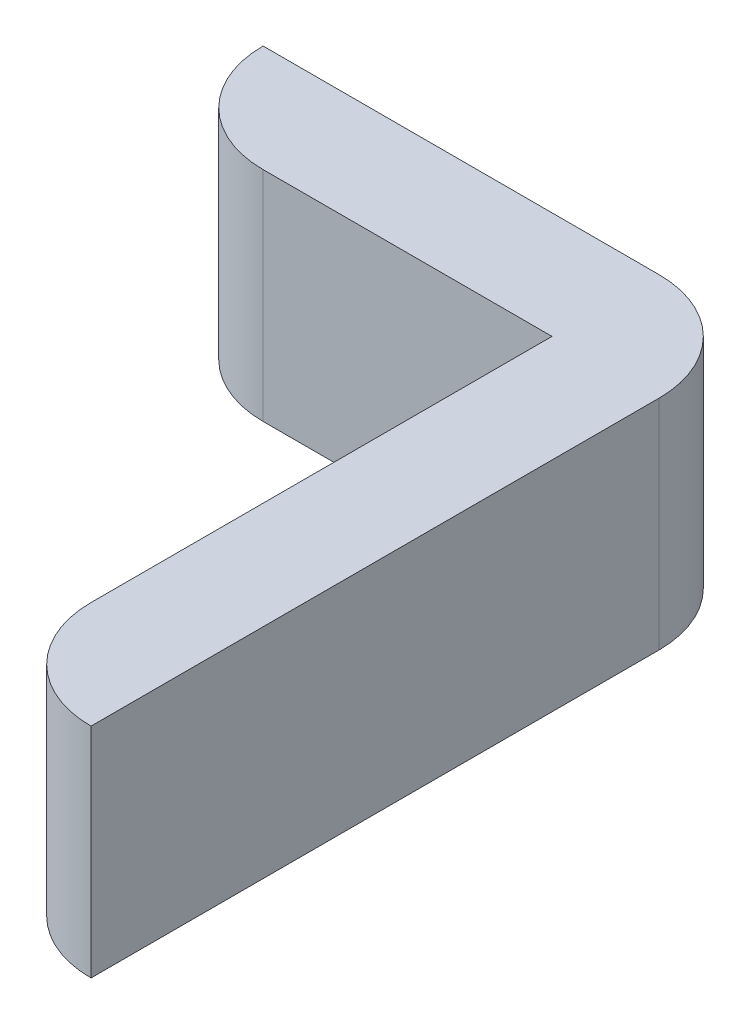
ISO-10303-21;
HEADER;
FILE_DESCRIPTION(('STEP AP214'),'2;1');
FILE_NAME('part.step','',(''),(''),'','','');
FILE_SCHEMA(('AUTOMOTIVE_DESIGN { 1 0 10303 214 1 1 1 1 }'));
ENDSEC;
DATA;
#1=APPLICATION_CONTEXT('core data for automotive mechanical design processes');
#2=APPLICATION_PROTOCOL_DEFINITION('international standard','automotive_design',2000,#1);
#3=PRODUCT_CONTEXT('',#1,'mechanical');
#4=PRODUCT('Part','Part','',(#3));
#5=PRODUCT_RELATED_PRODUCT_CATEGORY('part','',(#4));
#6=PRODUCT_DEFINITION_FORMATION('','',#4);
#7=PRODUCT_DEFINITION_CONTEXT('part definition',#1,'design');
#8=PRODUCT_DEFINITION('design','',#6,#7);
#9=PRODUCT_DEFINITION_SHAPE('','',#8);
#10=(LENGTH_UNIT() NAMED_UNIT(*) SI_UNIT(.MILLI.,.METRE.));
#11=(NAMED_UNIT(*) PLANE_ANGLE_UNIT() SI_UNIT($,.RADIAN.));
#12=(NAMED_UNIT(*) SI_UNIT($,.STERADIAN.) SOLID_ANGLE_UNIT());
#13=UNCERTAINTY_MEASURE_WITH_UNIT(LENGTH_MEASURE(1.E-05),#10,'distance_accuracy_value','');
#14=(GEOMETRIC_REPRESENTATION_CONTEXT(3) GLOBAL_UNCERTAINTY_ASSIGNED_CONTEXT((#13)) GLOBAL_UNIT_ASSIGNED_CONTEXT((#10,
#11,#12)) REPRESENTATION_CONTEXT('',''));
#15=CARTESIAN_POINT('',(0.,0.,0.));
#16=DIRECTION('',(0.,0.,1.));
#17=DIRECTION('',(1.,0.,0.));
#18=AXIS2_PLACEMENT_3D('',#15,#16,#17);
#19=CARTESIAN_POINT('',(-0.125,-1.0152,0.));
#20=DIRECTION('',(0.,-1.,0.));
#21=DIRECTION('',(0.,0.,-1.));
#22=AXIS2_PLACEMENT_3D('',#19,#20,#21);
#23=PLANE('',#22);
#24=DIRECTION('',(-1.,0.,0.));
#25=VECTOR('',#24,1.);
#26=CARTESIAN_POINT('',(0.125,-1.0152,0.25));
#27=LINE('',#26,#25);
#28=CARTESIAN_POINT('',(0.125,-1.0152,0.25));
#29=VERTEX_POINT('',#28);
#30=CARTESIAN_POINT('',(0.8,-1.0152,0.25));
#31=VERTEX_POINT('',#30);
#32=EDGE_CURVE('E102',#29,#31,#27,.F.);
#33=ORIENTED_EDGE('',*,*,#32,.T.);
#34=DIRECTION('',(0.,0.,-1.));
#35=VECTOR('',#34,1.);
#36=CARTESIAN_POINT('',(0.8,-1.0152,0.25));
#37=LINE('',#36,#35);
#38=CARTESIAN_POINT('',(0.8,-1.0152,1.327));
#39=VERTEX_POINT('',#38);
#40=EDGE_CURVE('E108',#31,#39,#37,.F.);
#41=ORIENTED_EDGE('',*,*,#40,.T.);
#42=CARTESIAN_POINT('',(1.05,-1.0152,1.327));
#43=DIRECTION('',(0.,-1.,0.));
#44=DIRECTION('',(0.,0.,-1.));
#45=AXIS2_PLACEMENT_3D('',#42,#43,#44);
#46=CIRCLE('',#45,0.25);
#47=CARTESIAN_POINT('',(1.05,-1.0152,1.577));
#48=VERTEX_POINT('',#47);
#49=EDGE_CURVE('E80',#48,#39,#46,.T.);
#50=ORIENTED_EDGE('',*,*,#49,.F.);
#51=DIRECTION('',(0.,0.,1.));
#52=VECTOR('',#51,1.);
#53=CARTESIAN_POINT('',(1.05,-1.0152,1.577));
#54=LINE('',#53,#52);
#55=CARTESIAN_POINT('',(1.05,-1.0152,0.25));
#56=VERTEX_POINT('',#55);
#57=EDGE_CURVE('E75',#48,#56,#54,.F.);
#58=ORIENTED_EDGE('',*,*,#57,.T.);
#59=CARTESIAN_POINT('',(0.8,-1.0152,0.25));
#60=DIRECTION('',(0.,-1.,0.));
#61=DIRECTION('',(0.,0.,-1.));
#62=AXIS2_PLACEMENT_3D('',#59,#60,#61);
#63=CIRCLE('',#62,0.25);
#64=CARTESIAN_POINT('',(0.8,-1.0152,0.));
#65=VERTEX_POINT('',#64);
#66=EDGE_CURVE('E19',#65,#56,#63,.T.);
#67=ORIENTED_EDGE('',*,*,#66,.F.);
#68=DIRECTION('',(1.,0.,0.));
#69=VECTOR('',#68,1.);
#70=CARTESIAN_POINT('',(0.8,-1.0152,0.));
#71=LINE('',#70,#69);
#72=CARTESIAN_POINT('',(-0.125,-1.0152,0.));
#73=VERTEX_POINT('',#72);
#74=EDGE_CURVE('E70',#65,#73,#71,.F.);
#75=ORIENTED_EDGE('',*,*,#74,.T.);
#76=CARTESIAN_POINT('',(0.125,-1.0152,0.));
#77=DIRECTION('',(0.,-1.,0.));
#78=DIRECTION('',(0.,0.,-1.));
#79=AXIS2_PLACEMENT_3D('',#76,#77,#78);
#80=CIRCLE('',#79,0.25);
#81=EDGE_CURVE('E121',#29,#73,#80,.T.);
#82=ORIENTED_EDGE('',*,*,#81,.F.);
#83=EDGE_LOOP('',(#33,#41,#50,#58,#67,#75,#82));
#84=FACE_BOUND('',#83,.T.);
#85=ADVANCED_FACE('F16',(#84),#23,.F.);
#86=CARTESIAN_POINT('',(0.8,-1.5248,0.));
#87=DIRECTION('',(0.,0.,1.));
#88=DIRECTION('',(1.,0.,0.));
#89=AXIS2_PLACEMENT_3D('',#86,#87,#88);
#90=PLANE('',#89);
#91=DIRECTION('',(0.,-1.,0.));
#92=VECTOR('',#91,1.);
#93=CARTESIAN_POINT('',(-0.125,-1.5248,0.));
#94=LINE('',#93,#92);
#95=CARTESIAN_POINT('',(-0.125,-1.5248,0.));
#96=VERTEX_POINT('',#95);
#97=EDGE_CURVE('E123',#73,#96,#94,.T.);
#98=ORIENTED_EDGE('',*,*,#97,.F.);
#99=ORIENTED_EDGE('',*,*,#74,.F.);
#100=DIRECTION('',(0.,-1.,0.));
#101=VECTOR('',#100,1.);
#102=CARTESIAN_POINT('',(0.8,-1.5248,0.));
#103=LINE('',#102,#101);
#104=CARTESIAN_POINT('',(0.8,-1.5248,0.));
#105=VERTEX_POINT('',#104);
#106=EDGE_CURVE('E92',#105,#65,#103,.F.);
#107=ORIENTED_EDGE('',*,*,#106,.F.);
#108=DIRECTION('',(1.,0.,0.));
#109=VECTOR('',#108,1.);
#110=CARTESIAN_POINT('',(-0.125,-1.5248,0.));
#111=LINE('',#110,#109);
#112=EDGE_CURVE('E120',#96,#105,#111,.T.);
#113=ORIENTED_EDGE('',*,*,#112,.F.);
#114=EDGE_LOOP('',(#98,#99,#107,#113));
#115=FACE_BOUND('',#114,.T.);
#116=ADVANCED_FACE('F158',(#115),#90,.F.);
#117=CARTESIAN_POINT('',(0.8,-1.5248,0.25));
#118=DIRECTION('',(0.,-1.,0.));
#119=DIRECTION('',(0.,0.,-1.));
#120=AXIS2_PLACEMENT_3D('',#117,#118,#119);
#121=CYLINDRICAL_SURFACE('',#120,0.25);
#122=ORIENTED_EDGE('',*,*,#66,.T.);
#123=DIRECTION('',(0.,1.,0.));
#124=VECTOR('',#123,1.);
#125=CARTESIAN_POINT('',(1.05,-1.5248,0.25));
#126=LINE('',#125,#124);
#127=CARTESIAN_POINT('',(1.05,-1.5248,0.25));
#128=VERTEX_POINT('',#127);
#129=EDGE_CURVE('E86',#56,#128,#126,.F.);
#130=ORIENTED_EDGE('',*,*,#129,.T.);
#131=CARTESIAN_POINT('',(0.8,-1.5248,0.25));
#132=DIRECTION('',(0.,-1.,0.));
#133=DIRECTION('',(0.,0.,-1.));
#134=AXIS2_PLACEMENT_3D('',#131,#132,#133);
#135=CIRCLE('',#134,0.25);
#136=EDGE_CURVE('E118',#105,#128,#135,.T.);
#137=ORIENTED_EDGE('',*,*,#136,.F.);
#138=ORIENTED_EDGE('',*,*,#106,.T.);
#139=EDGE_LOOP('',(#122,#130,#137,#138));
#140=FACE_BOUND('',#139,.T.);
#141=ADVANCED_FACE('F89',(#140),#121,.T.);
#142=CARTESIAN_POINT('',(1.05,-1.5248,1.577));
#143=DIRECTION('',(-1.,0.,0.));
#144=DIRECTION('',(0.,0.,1.));
#145=AXIS2_PLACEMENT_3D('',#142,#143,#144);
#146=PLANE('',#145);
#147=DIRECTION('',(0.,-1.,0.));
#148=VECTOR('',#147,1.);
#149=CARTESIAN_POINT('',(1.05,-1.5248,1.577));
#150=LINE('',#149,#148);
#151=CARTESIAN_POINT('',(1.05,-1.5248,1.577));
#152=VERTEX_POINT('',#151);
#153=EDGE_CURVE('E85',#152,#48,#150,.F.);
#154=ORIENTED_EDGE('',*,*,#153,.F.);
#155=DIRECTION('',(0.,0.,-1.));
#156=VECTOR('',#155,1.);
#157=CARTESIAN_POINT('',(1.05,-1.5248,0.));
#158=LINE('',#157,#156);
#159=EDGE_CURVE('E94',#128,#152,#158,.F.);
#160=ORIENTED_EDGE('',*,*,#159,.F.);
#161=ORIENTED_EDGE('',*,*,#129,.F.);
#162=ORIENTED_EDGE('',*,*,#57,.F.);
#163=EDGE_LOOP('',(#154,#160,#161,#162));
#164=FACE_BOUND('',#163,.T.);
#165=ADVANCED_FACE('F93',(#164),#146,.F.);
#166=CARTESIAN_POINT('',(1.05,-1.5248,1.327));
#167=DIRECTION('',(0.,-1.,0.));
#168=DIRECTION('',(0.,0.,-1.));
#169=AXIS2_PLACEMENT_3D('',#166,#167,#168);
#170=CYLINDRICAL_SURFACE('',#169,0.25);
#171=ORIENTED_EDGE('',*,*,#49,.T.);
#172=DIRECTION('',(0.,1.,0.));
#173=VECTOR('',#172,1.);
#174=CARTESIAN_POINT('',(0.8,-1.5248,1.327));
#175=LINE('',#174,#173);
#176=CARTESIAN_POINT('',(0.8,-1.5248,1.327));
#177=VERTEX_POINT('',#176);
#178=EDGE_CURVE('E105',#39,#177,#175,.F.);
#179=ORIENTED_EDGE('',*,*,#178,.T.);
#180=CARTESIAN_POINT('',(1.05,-1.5248,1.327));
#181=DIRECTION('',(0.,-1.,0.));
#182=DIRECTION('',(0.,0.,-1.));
#183=AXIS2_PLACEMENT_3D('',#180,#181,#182);
#184=CIRCLE('',#183,0.25);
#185=EDGE_CURVE('E114',#152,#177,#184,.T.);
#186=ORIENTED_EDGE('',*,*,#185,.F.);
#187=ORIENTED_EDGE('',*,*,#153,.T.);
#188=EDGE_LOOP('',(#171,#179,#186,#187));
#189=FACE_BOUND('',#188,.T.);
#190=ADVANCED_FACE('F127',(#189),#170,.T.);
#191=CARTESIAN_POINT('',(0.8,-1.5248,0.25));
#192=DIRECTION('',(1.,0.,0.));
#193=DIRECTION('',(0.,0.,-1.));
#194=AXIS2_PLACEMENT_3D('',#191,#192,#193);
#195=PLANE('',#194);
#196=ORIENTED_EDGE('',*,*,#178,.F.);
#197=ORIENTED_EDGE('',*,*,#40,.F.);
#198=DIRECTION('',(0.,1.,0.));
#199=VECTOR('',#198,1.);
#200=CARTESIAN_POINT('',(0.8,-1.5248,0.25));
#201=LINE('',#200,#199);
#202=CARTESIAN_POINT('',(0.8,-1.5248,0.25));
#203=VERTEX_POINT('',#202);
#204=EDGE_CURVE('E104',#31,#203,#201,.F.);
#205=ORIENTED_EDGE('',*,*,#204,.T.);
#206=DIRECTION('',(0.,0.,-1.));
#207=VECTOR('',#206,1.);
#208=CARTESIAN_POINT('',(0.8,-1.5248,0.));
#209=LINE('',#208,#207);
#210=EDGE_CURVE('E117',#177,#203,#209,.T.);
#211=ORIENTED_EDGE('',*,*,#210,.F.);
#212=EDGE_LOOP('',(#196,#197,#205,#211));
#213=FACE_BOUND('',#212,.T.);
#214=ADVANCED_FACE('F150',(#213),#195,.F.);
#215=CARTESIAN_POINT('',(0.125,-1.5248,0.25));
#216=DIRECTION('',(0.,0.,-1.));
#217=DIRECTION('',(-1.,0.,0.));
#218=AXIS2_PLACEMENT_3D('',#215,#216,#217);
#219=PLANE('',#218);
#220=ORIENTED_EDGE('',*,*,#204,.F.);
#221=ORIENTED_EDGE('',*,*,#32,.F.);
#222=DIRECTION('',(0.,-1.,0.));
#223=VECTOR('',#222,1.);
#224=CARTESIAN_POINT('',(0.125,-1.5248,0.25));
#225=LINE('',#224,#223);
#226=CARTESIAN_POINT('',(0.125,-1.5248,0.25));
#227=VERTEX_POINT('',#226);
#228=EDGE_CURVE('E34',#227,#29,#225,.F.);
#229=ORIENTED_EDGE('',*,*,#228,.F.);
#230=DIRECTION('',(1.,0.,0.));
#231=VECTOR('',#230,1.);
#232=CARTESIAN_POINT('',(-0.125,-1.5248,0.25));
#233=LINE('',#232,#231);
#234=EDGE_CURVE('E25',#203,#227,#233,.F.);
#235=ORIENTED_EDGE('',*,*,#234,.F.);
#236=EDGE_LOOP('',(#220,#221,#229,#235));
#237=FACE_BOUND('',#236,.T.);
#238=ADVANCED_FACE('F151',(#237),#219,.F.);
#239=CARTESIAN_POINT('',(0.125,-1.5248,0.));
#240=DIRECTION('',(0.,-1.,0.));
#241=DIRECTION('',(0.,0.,-1.));
#242=AXIS2_PLACEMENT_3D('',#239,#240,#241);
#243=CYLINDRICAL_SURFACE('',#242,0.25);
#244=ORIENTED_EDGE('',*,*,#81,.T.);
#245=ORIENTED_EDGE('',*,*,#97,.T.);
#246=CARTESIAN_POINT('',(0.125,-1.5248,0.));
#247=DIRECTION('',(0.,-1.,0.));
#248=DIRECTION('',(0.,0.,-1.));
#249=AXIS2_PLACEMENT_3D('',#246,#247,#248);
#250=CIRCLE('',#249,0.25);
#251=EDGE_CURVE('E11',#227,#96,#250,.T.);
#252=ORIENTED_EDGE('',*,*,#251,.F.);
#253=ORIENTED_EDGE('',*,*,#228,.T.);
#254=EDGE_LOOP('',(#244,#245,#252,#253));
#255=FACE_BOUND('',#254,.T.);
#256=ADVANCED_FACE('F156',(#255),#243,.T.);
#257=CARTESIAN_POINT('',(-0.125,-1.5248,0.));
#258=DIRECTION('',(0.,-1.,0.));
#259=DIRECTION('',(0.,0.,-1.));
#260=AXIS2_PLACEMENT_3D('',#257,#258,#259);
#261=PLANE('',#260);
#262=ORIENTED_EDGE('',*,*,#234,.T.);
#263=ORIENTED_EDGE('',*,*,#251,.T.);
#264=ORIENTED_EDGE('',*,*,#112,.T.);
#265=ORIENTED_EDGE('',*,*,#136,.T.);
#266=ORIENTED_EDGE('',*,*,#159,.T.);
#267=ORIENTED_EDGE('',*,*,#185,.T.);
#268=ORIENTED_EDGE('',*,*,#210,.T.);
#269=EDGE_LOOP('',(#262,#263,#264,#265,#266,#267,#268));
#270=FACE_BOUND('',#269,.T.);
#271=ADVANCED_FACE('F132',(#270),#261,.T.);
#272=CLOSED_SHELL('',(#85,#116,#141,#165,#190,#214,#238,#256,#271));
#273=MANIFOLD_SOLID_BREP('B1',#272);
#274=ADVANCED_BREP_SHAPE_REPRESENTATION('',(#18,#273),#14);
#275=SHAPE_DEFINITION_REPRESENTATION(#9,#274);
ENDSEC;
END-ISO-10303-21;
